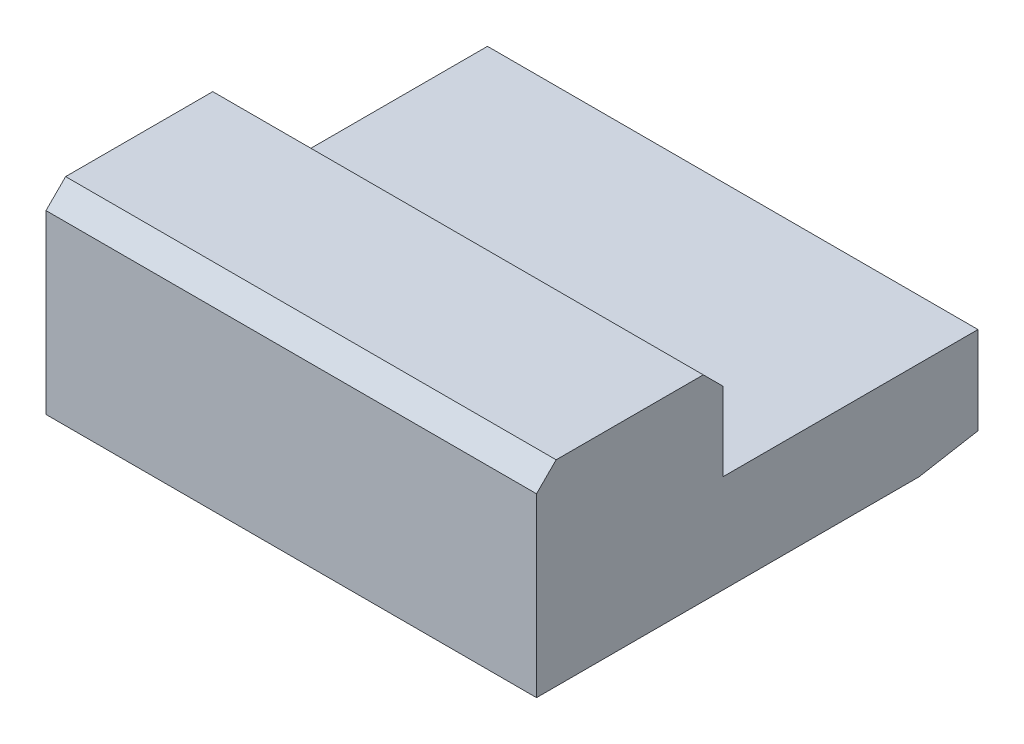
ISO-10303-21;
HEADER;
FILE_DESCRIPTION(('STEP AP214'),'2;1');
FILE_NAME('part.step','',(''),(''),'','','');
FILE_SCHEMA(('AUTOMOTIVE_DESIGN { 1 0 10303 214 1 1 1 1 }'));
ENDSEC;
DATA;
#1=APPLICATION_CONTEXT('core data for automotive mechanical design processes');
#2=APPLICATION_PROTOCOL_DEFINITION('international standard','automotive_design',2000,#1);
#3=PRODUCT_CONTEXT('',#1,'mechanical');
#4=PRODUCT('Part','Part','',(#3));
#5=PRODUCT_RELATED_PRODUCT_CATEGORY('part','',(#4));
#6=PRODUCT_DEFINITION_FORMATION('','',#4);
#7=PRODUCT_DEFINITION_CONTEXT('part definition',#1,'design');
#8=PRODUCT_DEFINITION('design','',#6,#7);
#9=PRODUCT_DEFINITION_SHAPE('','',#8);
#10=(LENGTH_UNIT() NAMED_UNIT(*) SI_UNIT(.MILLI.,.METRE.));
#11=(NAMED_UNIT(*) PLANE_ANGLE_UNIT() SI_UNIT($,.RADIAN.));
#12=(NAMED_UNIT(*) SI_UNIT($,.STERADIAN.) SOLID_ANGLE_UNIT());
#13=UNCERTAINTY_MEASURE_WITH_UNIT(LENGTH_MEASURE(1.E-05),#10,'distance_accuracy_value','');
#14=(GEOMETRIC_REPRESENTATION_CONTEXT(3) GLOBAL_UNCERTAINTY_ASSIGNED_CONTEXT((#13)) GLOBAL_UNIT_ASSIGNED_CONTEXT((#10,
#11,#12)) REPRESENTATION_CONTEXT('',''));
#15=CARTESIAN_POINT('',(0.,0.,0.));
#16=DIRECTION('',(0.,0.,1.));
#17=DIRECTION('',(1.,0.,0.));
#18=AXIS2_PLACEMENT_3D('',#15,#16,#17);
#19=CARTESIAN_POINT('',(-2.5,0.,-1.998615454115));
#20=DIRECTION('',(0.,0.984807753012213,0.173648177666903));
#21=DIRECTION('',(1.,0.,0.));
#22=AXIS2_PLACEMENT_3D('',#19,#20,#21);
#23=PLANE('',#22);
#24=DIRECTION('',(0.,0.173648177666903,-0.984807753012213));
#25=VECTOR('',#24,1.);
#26=CARTESIAN_POINT('',(2.5,0.,-1.998615454115));
#27=LINE('',#26,#25);
#28=CARTESIAN_POINT('',(2.5,0.,-1.998615454115));
#29=VERTEX_POINT('',#28);
#30=CARTESIAN_POINT('',(2.5,0.1060403212207,-2.6));
#31=VERTEX_POINT('',#30);
#32=EDGE_CURVE('E163',#29,#31,#27,.T.);
#33=ORIENTED_EDGE('',*,*,#32,.F.);
#34=DIRECTION('',(1.,0.,0.));
#35=VECTOR('',#34,1.);
#36=CARTESIAN_POINT('',(-2.5,0.,-1.998615454115));
#37=LINE('',#36,#35);
#38=CARTESIAN_POINT('',(-2.5,0.,-1.998615454115));
#39=VERTEX_POINT('',#38);
#40=EDGE_CURVE('E11',#39,#29,#37,.T.);
#41=ORIENTED_EDGE('',*,*,#40,.F.);
#42=DIRECTION('',(0.,0.173648177666903,-0.984807753012213));
#43=VECTOR('',#42,1.);
#44=CARTESIAN_POINT('',(-2.5,0.,-1.998615454115));
#45=LINE('',#44,#43);
#46=CARTESIAN_POINT('',(-2.5,0.1060403212207,-2.6));
#47=VERTEX_POINT('',#46);
#48=EDGE_CURVE('E21',#39,#47,#45,.T.);
#49=ORIENTED_EDGE('',*,*,#48,.T.);
#50=DIRECTION('',(-1.,0.,0.));
#51=VECTOR('',#50,1.);
#52=CARTESIAN_POINT('',(2.5,0.1060403212207,-2.6));
#53=LINE('',#52,#51);
#54=EDGE_CURVE('E154',#31,#47,#53,.T.);
#55=ORIENTED_EDGE('',*,*,#54,.F.);
#56=EDGE_LOOP('',(#33,#41,#49,#55));
#57=FACE_BOUND('',#56,.T.);
#58=ADVANCED_FACE('F17',(#57),#23,.F.);
#59=CARTESIAN_POINT('',(-2.5,0.,0.));
#60=DIRECTION('',(0.,-1.,0.));
#61=DIRECTION('',(0.,0.,-1.));
#62=AXIS2_PLACEMENT_3D('',#59,#60,#61);
#63=PLANE('',#62);
#64=DIRECTION('',(0.,0.,1.));
#65=VECTOR('',#64,1.);
#66=CARTESIAN_POINT('',(2.5,0.,-1.998615454115));
#67=LINE('',#66,#65);
#68=CARTESIAN_POINT('',(2.5,0.,1.9));
#69=VERTEX_POINT('',#68);
#70=EDGE_CURVE('E167',#29,#69,#67,.T.);
#71=ORIENTED_EDGE('',*,*,#70,.T.);
#72=DIRECTION('',(1.,0.,0.));
#73=VECTOR('',#72,1.);
#74=CARTESIAN_POINT('',(-2.5,0.,1.9));
#75=LINE('',#74,#73);
#76=CARTESIAN_POINT('',(-2.5,0.,1.9));
#77=VERTEX_POINT('',#76);
#78=EDGE_CURVE('E28',#77,#69,#75,.T.);
#79=ORIENTED_EDGE('',*,*,#78,.F.);
#80=DIRECTION('',(0.,0.,-1.));
#81=VECTOR('',#80,1.);
#82=CARTESIAN_POINT('',(-2.5,0.,1.9));
#83=LINE('',#82,#81);
#84=EDGE_CURVE('E189',#77,#39,#83,.T.);
#85=ORIENTED_EDGE('',*,*,#84,.T.);
#86=ORIENTED_EDGE('',*,*,#40,.T.);
#87=EDGE_LOOP('',(#71,#79,#85,#86));
#88=FACE_BOUND('',#87,.T.);
#89=ADVANCED_FACE('F245',(#88),#63,.T.);
#90=CARTESIAN_POINT('',(0.,0.,1.9));
#91=DIRECTION('',(0.,0.,1.));
#92=DIRECTION('',(1.,0.,0.));
#93=AXIS2_PLACEMENT_3D('',#90,#91,#92);
#94=PLANE('',#93);
#95=DIRECTION('',(0.,-1.,0.));
#96=VECTOR('',#95,1.);
#97=CARTESIAN_POINT('',(-2.5,1.8,1.9));
#98=LINE('',#97,#96);
#99=CARTESIAN_POINT('',(-2.5,1.8,1.9));
#100=VERTEX_POINT('',#99);
#101=EDGE_CURVE('E171',#100,#77,#98,.T.);
#102=ORIENTED_EDGE('',*,*,#101,.T.);
#103=ORIENTED_EDGE('',*,*,#78,.T.);
#104=DIRECTION('',(0.,1.,0.));
#105=VECTOR('',#104,1.);
#106=CARTESIAN_POINT('',(2.5,0.,1.9));
#107=LINE('',#106,#105);
#108=CARTESIAN_POINT('',(2.5,1.8,1.9));
#109=VERTEX_POINT('',#108);
#110=EDGE_CURVE('E341',#69,#109,#107,.T.);
#111=ORIENTED_EDGE('',*,*,#110,.T.);
#112=DIRECTION('',(-1.,0.,0.));
#113=VECTOR('',#112,1.);
#114=CARTESIAN_POINT('',(2.5,1.8,1.9));
#115=LINE('',#114,#113);
#116=EDGE_CURVE('E174',#109,#100,#115,.T.);
#117=ORIENTED_EDGE('',*,*,#116,.T.);
#118=EDGE_LOOP('',(#102,#103,#111,#117));
#119=FACE_BOUND('',#118,.T.);
#120=ADVANCED_FACE('F19',(#119),#94,.T.);
#121=CARTESIAN_POINT('',(0.,1.9,1.8));
#122=DIRECTION('',(0.,0.707106781186548,0.707106781186548));
#123=DIRECTION('',(1.,0.,0.));
#124=AXIS2_PLACEMENT_3D('',#121,#122,#123);
#125=PLANE('',#124);
#126=ORIENTED_EDGE('',*,*,#116,.F.);
#127=DIRECTION('',(0.,-0.707106781186548,0.707106781186548));
#128=VECTOR('',#127,1.);
#129=CARTESIAN_POINT('',(2.5,2.,1.7));
#130=LINE('',#129,#128);
#131=CARTESIAN_POINT('',(2.5,2.,1.7));
#132=VERTEX_POINT('',#131);
#133=EDGE_CURVE('E344',#132,#109,#130,.T.);
#134=ORIENTED_EDGE('',*,*,#133,.F.);
#135=DIRECTION('',(-1.,0.,0.));
#136=VECTOR('',#135,1.);
#137=CARTESIAN_POINT('',(2.5,2.,1.7));
#138=LINE('',#137,#136);
#139=CARTESIAN_POINT('',(-2.5,2.,1.7));
#140=VERTEX_POINT('',#139);
#141=EDGE_CURVE('E42',#132,#140,#138,.T.);
#142=ORIENTED_EDGE('',*,*,#141,.T.);
#143=DIRECTION('',(0.,0.707106781186548,-0.707106781186548));
#144=VECTOR('',#143,1.);
#145=CARTESIAN_POINT('',(-2.5,1.8,1.9));
#146=LINE('',#145,#144);
#147=EDGE_CURVE('E168',#100,#140,#146,.T.);
#148=ORIENTED_EDGE('',*,*,#147,.F.);
#149=EDGE_LOOP('',(#126,#134,#142,#148));
#150=FACE_BOUND('',#149,.T.);
#151=ADVANCED_FACE('F207',(#150),#125,.T.);
#152=CARTESIAN_POINT('',(2.5,2.,0.));
#153=DIRECTION('',(0.,1.,0.));
#154=DIRECTION('',(1.,0.,0.));
#155=AXIS2_PLACEMENT_3D('',#152,#153,#154);
#156=PLANE('',#155);
#157=DIRECTION('',(0.,0.,1.));
#158=VECTOR('',#157,1.);
#159=CARTESIAN_POINT('',(2.5,2.,0.2));
#160=LINE('',#159,#158);
#161=CARTESIAN_POINT('',(2.5,2.,0.2));
#162=VERTEX_POINT('',#161);
#163=EDGE_CURVE('E331',#162,#132,#160,.T.);
#164=ORIENTED_EDGE('',*,*,#163,.F.);
#165=DIRECTION('',(1.,0.,0.));
#166=VECTOR('',#165,1.);
#167=CARTESIAN_POINT('',(-2.5,2.,0.2));
#168=LINE('',#167,#166);
#169=CARTESIAN_POINT('',(-2.5,2.,0.2));
#170=VERTEX_POINT('',#169);
#171=EDGE_CURVE('E124',#170,#162,#168,.T.);
#172=ORIENTED_EDGE('',*,*,#171,.F.);
#173=DIRECTION('',(0.,0.,1.));
#174=VECTOR('',#173,1.);
#175=CARTESIAN_POINT('',(-2.5,2.,0.2));
#176=LINE('',#175,#174);
#177=EDGE_CURVE('E86',#170,#140,#176,.T.);
#178=ORIENTED_EDGE('',*,*,#177,.T.);
#179=ORIENTED_EDGE('',*,*,#141,.F.);
#180=EDGE_LOOP('',(#164,#172,#178,#179));
#181=FACE_BOUND('',#180,.T.);
#182=ADVANCED_FACE('F202',(#181),#156,.T.);
#183=CARTESIAN_POINT('',(-2.5,2.,0.));
#184=DIRECTION('',(-1.,0.,0.));
#185=DIRECTION('',(0.,0.,1.));
#186=AXIS2_PLACEMENT_3D('',#183,#184,#185);
#187=PLANE('',#186);
#188=ORIENTED_EDGE('',*,*,#48,.F.);
#189=ORIENTED_EDGE('',*,*,#84,.F.);
#190=ORIENTED_EDGE('',*,*,#101,.F.);
#191=ORIENTED_EDGE('',*,*,#147,.T.);
#192=ORIENTED_EDGE('',*,*,#177,.F.);
#193=DIRECTION('',(0.,-0.707106781186548,-0.707106781186548));
#194=VECTOR('',#193,1.);
#195=CARTESIAN_POINT('',(-2.5,2.,0.2));
#196=LINE('',#195,#194);
#197=CARTESIAN_POINT('',(-2.5,1.8,0.));
#198=VERTEX_POINT('',#197);
#199=EDGE_CURVE('E95',#170,#198,#196,.T.);
#200=ORIENTED_EDGE('',*,*,#199,.T.);
#201=DIRECTION('',(0.,-1.,0.));
#202=VECTOR('',#201,1.);
#203=CARTESIAN_POINT('',(-2.5,1.8,0.));
#204=LINE('',#203,#202);
#205=CARTESIAN_POINT('',(-2.5,1.,0.));
#206=VERTEX_POINT('',#205);
#207=EDGE_CURVE('E136',#198,#206,#204,.T.);
#208=ORIENTED_EDGE('',*,*,#207,.T.);
#209=DIRECTION('',(0.,0.,-1.));
#210=VECTOR('',#209,1.);
#211=CARTESIAN_POINT('',(-2.5,1.,0.));
#212=LINE('',#211,#210);
#213=CARTESIAN_POINT('',(-2.5,1.,-2.6));
#214=VERTEX_POINT('',#213);
#215=EDGE_CURVE('E177',#206,#214,#212,.T.);
#216=ORIENTED_EDGE('',*,*,#215,.T.);
#217=DIRECTION('',(0.,1.,0.));
#218=VECTOR('',#217,1.);
#219=CARTESIAN_POINT('',(-2.5,0.1060403212207,-2.6));
#220=LINE('',#219,#218);
#221=EDGE_CURVE('E157',#47,#214,#220,.T.);
#222=ORIENTED_EDGE('',*,*,#221,.F.);
#223=EDGE_LOOP('',(#188,#189,#190,#191,#192,#200,#208,#216,#222));
#224=FACE_BOUND('',#223,.T.);
#225=ADVANCED_FACE('F206',(#224),#187,.T.);
#226=CARTESIAN_POINT('',(-2.5,1.,0.));
#227=DIRECTION('',(0.,1.,0.));
#228=DIRECTION('',(1.,0.,0.));
#229=AXIS2_PLACEMENT_3D('',#226,#227,#228);
#230=PLANE('',#229);
#231=ORIENTED_EDGE('',*,*,#215,.F.);
#232=DIRECTION('',(1.,0.,0.));
#233=VECTOR('',#232,1.);
#234=CARTESIAN_POINT('',(-2.5,1.,0.));
#235=LINE('',#234,#233);
#236=CARTESIAN_POINT('',(2.5,1.,0.));
#237=VERTEX_POINT('',#236);
#238=EDGE_CURVE('E144',#206,#237,#235,.T.);
#239=ORIENTED_EDGE('',*,*,#238,.T.);
#240=DIRECTION('',(0.,0.,-1.));
#241=VECTOR('',#240,1.);
#242=CARTESIAN_POINT('',(2.5,1.,0.));
#243=LINE('',#242,#241);
#244=CARTESIAN_POINT('',(2.5,1.,-2.6));
#245=VERTEX_POINT('',#244);
#246=EDGE_CURVE('E129',#237,#245,#243,.T.);
#247=ORIENTED_EDGE('',*,*,#246,.T.);
#248=DIRECTION('',(1.,0.,0.));
#249=VECTOR('',#248,1.);
#250=CARTESIAN_POINT('',(-2.5,1.,-2.6));
#251=LINE('',#250,#249);
#252=EDGE_CURVE('E162',#214,#245,#251,.T.);
#253=ORIENTED_EDGE('',*,*,#252,.F.);
#254=EDGE_LOOP('',(#231,#239,#247,#253));
#255=FACE_BOUND('',#254,.T.);
#256=ADVANCED_FACE('F195',(#255),#230,.T.);
#257=CARTESIAN_POINT('',(0.,0.,-2.6));
#258=DIRECTION('',(0.,0.,-1.));
#259=DIRECTION('',(0.,-1.,0.));
#260=AXIS2_PLACEMENT_3D('',#257,#258,#259);
#261=PLANE('',#260);
#262=ORIENTED_EDGE('',*,*,#54,.T.);
#263=ORIENTED_EDGE('',*,*,#221,.T.);
#264=ORIENTED_EDGE('',*,*,#252,.T.);
#265=DIRECTION('',(0.,1.,0.));
#266=VECTOR('',#265,1.);
#267=CARTESIAN_POINT('',(2.5,0.1060403212207,-2.6));
#268=LINE('',#267,#266);
#269=EDGE_CURVE('E158',#31,#245,#268,.T.);
#270=ORIENTED_EDGE('',*,*,#269,.F.);
#271=EDGE_LOOP('',(#262,#263,#264,#270));
#272=FACE_BOUND('',#271,.T.);
#273=ADVANCED_FACE('F190',(#272),#261,.T.);
#274=CARTESIAN_POINT('',(2.5,0.,0.));
#275=DIRECTION('',(1.,0.,0.));
#276=DIRECTION('',(0.,1.,0.));
#277=AXIS2_PLACEMENT_3D('',#274,#275,#276);
#278=PLANE('',#277);
#279=ORIENTED_EDGE('',*,*,#246,.F.);
#280=DIRECTION('',(0.,1.,0.));
#281=VECTOR('',#280,1.);
#282=CARTESIAN_POINT('',(2.5,1.,0.));
#283=LINE('',#282,#281);
#284=CARTESIAN_POINT('',(2.5,1.8,0.));
#285=VERTEX_POINT('',#284);
#286=EDGE_CURVE('E135',#237,#285,#283,.T.);
#287=ORIENTED_EDGE('',*,*,#286,.T.);
#288=DIRECTION('',(0.,0.707106781186548,0.707106781186548));
#289=VECTOR('',#288,1.);
#290=CARTESIAN_POINT('',(2.5,1.8,0.));
#291=LINE('',#290,#289);
#292=EDGE_CURVE('E119',#285,#162,#291,.T.);
#293=ORIENTED_EDGE('',*,*,#292,.T.);
#294=ORIENTED_EDGE('',*,*,#163,.T.);
#295=ORIENTED_EDGE('',*,*,#133,.T.);
#296=ORIENTED_EDGE('',*,*,#110,.F.);
#297=ORIENTED_EDGE('',*,*,#70,.F.);
#298=ORIENTED_EDGE('',*,*,#32,.T.);
#299=ORIENTED_EDGE('',*,*,#269,.T.);
#300=EDGE_LOOP('',(#279,#287,#293,#294,#295,#296,#297,#298,#299));
#301=FACE_BOUND('',#300,.T.);
#302=ADVANCED_FACE('F139',(#301),#278,.T.);
#303=CARTESIAN_POINT('',(0.,1.9,0.1));
#304=DIRECTION('',(0.,0.707106781186548,-0.707106781186548));
#305=DIRECTION('',(-1.,0.,0.));
#306=AXIS2_PLACEMENT_3D('',#303,#304,#305);
#307=PLANE('',#306);
#308=DIRECTION('',(1.,0.,0.));
#309=VECTOR('',#308,1.);
#310=CARTESIAN_POINT('',(-2.5,1.8,0.));
#311=LINE('',#310,#309);
#312=EDGE_CURVE('E122',#198,#285,#311,.T.);
#313=ORIENTED_EDGE('',*,*,#312,.F.);
#314=ORIENTED_EDGE('',*,*,#199,.F.);
#315=ORIENTED_EDGE('',*,*,#171,.T.);
#316=ORIENTED_EDGE('',*,*,#292,.F.);
#317=EDGE_LOOP('',(#313,#314,#315,#316));
#318=FACE_BOUND('',#317,.T.);
#319=ADVANCED_FACE('F121',(#318),#307,.T.);
#320=CARTESIAN_POINT('',(0.,0.,0.));
#321=DIRECTION('',(0.,0.,1.));
#322=DIRECTION('',(1.,0.,0.));
#323=AXIS2_PLACEMENT_3D('',#320,#321,#322);
#324=PLANE('',#323);
#325=ORIENTED_EDGE('',*,*,#286,.F.);
#326=ORIENTED_EDGE('',*,*,#238,.F.);
#327=ORIENTED_EDGE('',*,*,#207,.F.);
#328=ORIENTED_EDGE('',*,*,#312,.T.);
#329=EDGE_LOOP('',(#325,#326,#327,#328));
#330=FACE_BOUND('',#329,.T.);
#331=ADVANCED_FACE('F133',(#330),#324,.F.);
#332=CLOSED_SHELL('',(#58,#89,#120,#151,#182,#225,#256,#273,#302,#319,#331));
#333=MANIFOLD_SOLID_BREP('B1',#332);
#334=ADVANCED_BREP_SHAPE_REPRESENTATION('',(#18,#333),#14);
#335=SHAPE_DEFINITION_REPRESENTATION(#9,#334);
ENDSEC;
END-ISO-10303-21;
